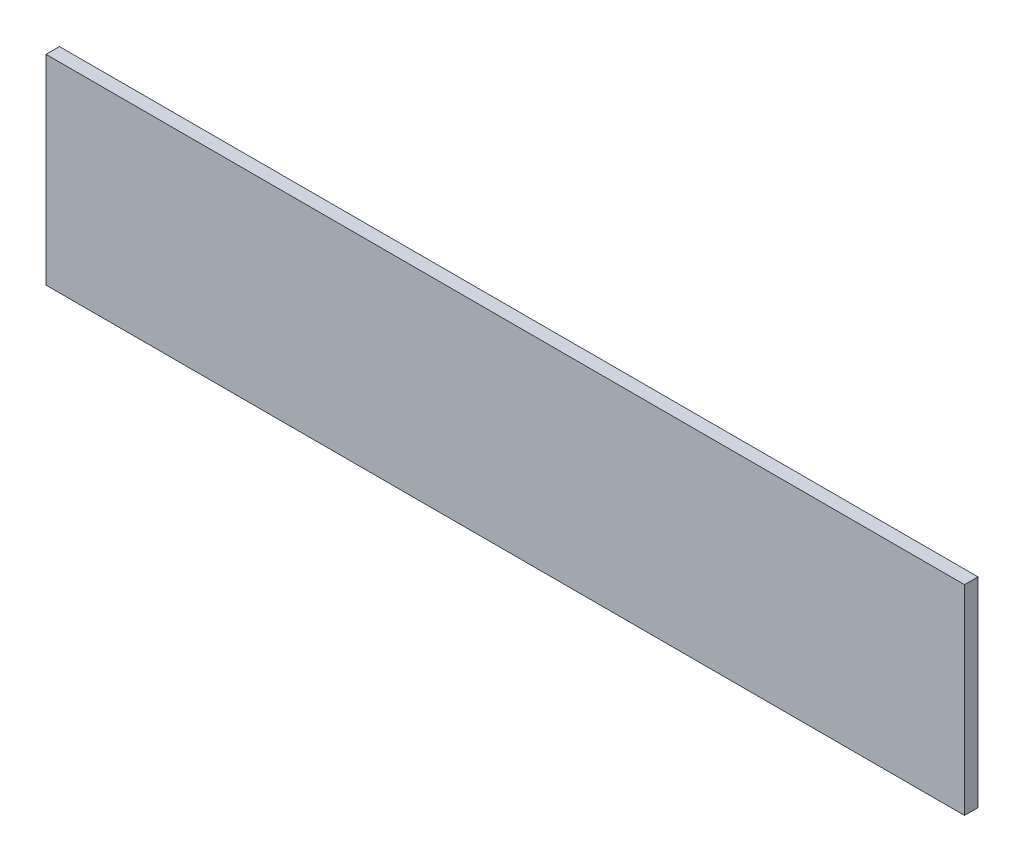
ISO-10303-21;
HEADER;
FILE_DESCRIPTION(('STEP AP214'),'2;1');
FILE_NAME('part.step','',(''),(''),'','','');
FILE_SCHEMA(('AUTOMOTIVE_DESIGN { 1 0 10303 214 1 1 1 1 }'));
ENDSEC;
DATA;
#1=APPLICATION_CONTEXT('core data for automotive mechanical design processes');
#2=APPLICATION_PROTOCOL_DEFINITION('international standard','automotive_design',2000,#1);
#3=PRODUCT_CONTEXT('',#1,'mechanical');
#4=PRODUCT('Part','Part','',(#3));
#5=PRODUCT_RELATED_PRODUCT_CATEGORY('part','',(#4));
#6=PRODUCT_DEFINITION_FORMATION('','',#4);
#7=PRODUCT_DEFINITION_CONTEXT('part definition',#1,'design');
#8=PRODUCT_DEFINITION('design','',#6,#7);
#9=PRODUCT_DEFINITION_SHAPE('','',#8);
#10=(LENGTH_UNIT() NAMED_UNIT(*) SI_UNIT(.MILLI.,.METRE.));
#11=(NAMED_UNIT(*) PLANE_ANGLE_UNIT() SI_UNIT($,.RADIAN.));
#12=(NAMED_UNIT(*) SI_UNIT($,.STERADIAN.) SOLID_ANGLE_UNIT());
#13=UNCERTAINTY_MEASURE_WITH_UNIT(LENGTH_MEASURE(1.E-05),#10,'distance_accuracy_value','');
#14=(GEOMETRIC_REPRESENTATION_CONTEXT(3) GLOBAL_UNCERTAINTY_ASSIGNED_CONTEXT((#13)) GLOBAL_UNIT_ASSIGNED_CONTEXT((#10,
#11,#12)) REPRESENTATION_CONTEXT('',''));
#15=CARTESIAN_POINT('',(0.,0.,0.));
#16=DIRECTION('',(0.,0.,1.));
#17=DIRECTION('',(1.,0.,0.));
#18=AXIS2_PLACEMENT_3D('',#15,#16,#17);
#19=CARTESIAN_POINT('',(19.4828493835392,-636.90036528036,3.));
#20=DIRECTION('',(1.,0.,0.));
#21=DIRECTION('',(0.,1.,0.));
#22=AXIS2_PLACEMENT_3D('',#19,#20,#21);
#23=PLANE('',#22);
#24=DIRECTION('',(0.,-1.,0.));
#25=VECTOR('',#24,1.);
#26=CARTESIAN_POINT('',(19.4828493835392,-636.90036528036,0.));
#27=LINE('',#26,#25);
#28=CARTESIAN_POINT('',(19.4828493835392,-636.90036528036,0.));
#29=VERTEX_POINT('',#28);
#30=CARTESIAN_POINT('',(19.4828493835393,-681.40036528036,0.));
#31=VERTEX_POINT('',#30);
#32=EDGE_CURVE('E117',#29,#31,#27,.T.);
#33=ORIENTED_EDGE('',*,*,#32,.T.);
#34=DIRECTION('',(0.,0.,-1.));
#35=VECTOR('',#34,1.);
#36=CARTESIAN_POINT('',(19.4828493835393,-681.40036528036,3.));
#37=LINE('',#36,#35);
#38=CARTESIAN_POINT('',(19.4828493835393,-681.40036528036,3.));
#39=VERTEX_POINT('',#38);
#40=EDGE_CURVE('E12',#39,#31,#37,.T.);
#41=ORIENTED_EDGE('',*,*,#40,.F.);
#42=DIRECTION('',(0.,-1.,0.));
#43=VECTOR('',#42,1.);
#44=CARTESIAN_POINT('',(19.4828493835392,-636.90036528036,3.));
#45=LINE('',#44,#43);
#46=CARTESIAN_POINT('',(19.4828493835392,-636.90036528036,3.));
#47=VERTEX_POINT('',#46);
#48=EDGE_CURVE('E86',#47,#39,#45,.T.);
#49=ORIENTED_EDGE('',*,*,#48,.F.);
#50=DIRECTION('',(0.,0.,-1.));
#51=VECTOR('',#50,1.);
#52=CARTESIAN_POINT('',(19.4828493835392,-636.90036528036,3.));
#53=LINE('',#52,#51);
#54=EDGE_CURVE('E97',#47,#29,#53,.T.);
#55=ORIENTED_EDGE('',*,*,#54,.T.);
#56=EDGE_LOOP('',(#33,#41,#49,#55));
#57=FACE_BOUND('',#56,.T.);
#58=ADVANCED_FACE('F35',(#57),#23,.F.);
#59=CARTESIAN_POINT('',(19.4828493835393,-681.40036528036,3.));
#60=DIRECTION('',(0.,1.,0.));
#61=DIRECTION('',(0.,0.,1.));
#62=AXIS2_PLACEMENT_3D('',#59,#60,#61);
#63=PLANE('',#62);
#64=DIRECTION('',(1.,0.,0.));
#65=VECTOR('',#64,1.);
#66=CARTESIAN_POINT('',(19.4828493835393,-681.40036528036,0.));
#67=LINE('',#66,#65);
#68=CARTESIAN_POINT('',(223.982849383539,-681.40036528036,0.));
#69=VERTEX_POINT('',#68);
#70=EDGE_CURVE('E91',#31,#69,#67,.T.);
#71=ORIENTED_EDGE('',*,*,#70,.T.);
#72=DIRECTION('',(0.,0.,-1.));
#73=VECTOR('',#72,1.);
#74=CARTESIAN_POINT('',(223.982849383539,-681.40036528036,3.));
#75=LINE('',#74,#73);
#76=CARTESIAN_POINT('',(223.982849383539,-681.40036528036,3.));
#77=VERTEX_POINT('',#76);
#78=EDGE_CURVE('E43',#77,#69,#75,.T.);
#79=ORIENTED_EDGE('',*,*,#78,.F.);
#80=DIRECTION('',(1.,0.,0.));
#81=VECTOR('',#80,1.);
#82=CARTESIAN_POINT('',(19.4828493835393,-681.40036528036,3.));
#83=LINE('',#82,#81);
#84=EDGE_CURVE('E81',#39,#77,#83,.T.);
#85=ORIENTED_EDGE('',*,*,#84,.F.);
#86=ORIENTED_EDGE('',*,*,#40,.T.);
#87=EDGE_LOOP('',(#71,#79,#85,#86));
#88=FACE_BOUND('',#87,.T.);
#89=ADVANCED_FACE('F90',(#88),#63,.F.);
#90=CARTESIAN_POINT('',(223.982849383539,-636.90036528036,3.));
#91=DIRECTION('',(-1.,0.,0.));
#92=DIRECTION('',(0.,0.,1.));
#93=AXIS2_PLACEMENT_3D('',#90,#91,#92);
#94=PLANE('',#93);
#95=DIRECTION('',(0.,1.,0.));
#96=VECTOR('',#95,1.);
#97=CARTESIAN_POINT('',(223.982849383539,-636.90036528036,0.));
#98=LINE('',#97,#96);
#99=CARTESIAN_POINT('',(223.982849383539,-636.90036528036,0.));
#100=VERTEX_POINT('',#99);
#101=EDGE_CURVE('E68',#69,#100,#98,.T.);
#102=ORIENTED_EDGE('',*,*,#101,.T.);
#103=DIRECTION('',(0.,0.,-1.));
#104=VECTOR('',#103,1.);
#105=CARTESIAN_POINT('',(223.982849383539,-636.90036528036,3.));
#106=LINE('',#105,#104);
#107=CARTESIAN_POINT('',(223.982849383539,-636.90036528036,3.));
#108=VERTEX_POINT('',#107);
#109=EDGE_CURVE('E92',#108,#100,#106,.T.);
#110=ORIENTED_EDGE('',*,*,#109,.F.);
#111=DIRECTION('',(0.,1.,0.));
#112=VECTOR('',#111,1.);
#113=CARTESIAN_POINT('',(223.982849383539,-636.90036528036,3.));
#114=LINE('',#113,#112);
#115=EDGE_CURVE('E84',#77,#108,#114,.T.);
#116=ORIENTED_EDGE('',*,*,#115,.F.);
#117=ORIENTED_EDGE('',*,*,#78,.T.);
#118=EDGE_LOOP('',(#102,#110,#116,#117));
#119=FACE_BOUND('',#118,.T.);
#120=ADVANCED_FACE('F93',(#119),#94,.F.);
#121=CARTESIAN_POINT('',(19.4828493835392,-636.90036528036,3.));
#122=DIRECTION('',(0.,-1.,0.));
#123=DIRECTION('',(0.,0.,-1.));
#124=AXIS2_PLACEMENT_3D('',#121,#122,#123);
#125=PLANE('',#124);
#126=DIRECTION('',(-1.,0.,0.));
#127=VECTOR('',#126,1.);
#128=CARTESIAN_POINT('',(19.4828493835392,-636.90036528036,0.));
#129=LINE('',#128,#127);
#130=EDGE_CURVE('E74',#100,#29,#129,.T.);
#131=ORIENTED_EDGE('',*,*,#130,.T.);
#132=ORIENTED_EDGE('',*,*,#54,.F.);
#133=DIRECTION('',(-1.,0.,0.));
#134=VECTOR('',#133,1.);
#135=CARTESIAN_POINT('',(19.4828493835392,-636.90036528036,3.));
#136=LINE('',#135,#134);
#137=EDGE_CURVE('E51',#108,#47,#136,.T.);
#138=ORIENTED_EDGE('',*,*,#137,.F.);
#139=ORIENTED_EDGE('',*,*,#109,.T.);
#140=EDGE_LOOP('',(#131,#132,#138,#139));
#141=FACE_BOUND('',#140,.T.);
#142=ADVANCED_FACE('F112',(#141),#125,.F.);
#143=CARTESIAN_POINT('',(19.4828493835393,-681.40036528036,3.));
#144=DIRECTION('',(0.,0.,1.));
#145=DIRECTION('',(1.,0.,0.));
#146=AXIS2_PLACEMENT_3D('',#143,#144,#145);
#147=PLANE('',#146);
#148=ORIENTED_EDGE('',*,*,#48,.T.);
#149=ORIENTED_EDGE('',*,*,#84,.T.);
#150=ORIENTED_EDGE('',*,*,#115,.T.);
#151=ORIENTED_EDGE('',*,*,#137,.T.);
#152=EDGE_LOOP('',(#148,#149,#150,#151));
#153=FACE_BOUND('',#152,.T.);
#154=ADVANCED_FACE('F82',(#153),#147,.T.);
#155=CARTESIAN_POINT('',(19.4828493835393,-681.40036528036,0.));
#156=DIRECTION('',(0.,0.,1.));
#157=DIRECTION('',(1.,0.,0.));
#158=AXIS2_PLACEMENT_3D('',#155,#156,#157);
#159=PLANE('',#158);
#160=ORIENTED_EDGE('',*,*,#32,.F.);
#161=ORIENTED_EDGE('',*,*,#130,.F.);
#162=ORIENTED_EDGE('',*,*,#101,.F.);
#163=ORIENTED_EDGE('',*,*,#70,.F.);
#164=EDGE_LOOP('',(#160,#161,#162,#163));
#165=FACE_BOUND('',#164,.T.);
#166=ADVANCED_FACE('F115',(#165),#159,.F.);
#167=CLOSED_SHELL('',(#58,#89,#120,#142,#154,#166));
#168=MANIFOLD_SOLID_BREP('B2',#167);
#169=ADVANCED_BREP_SHAPE_REPRESENTATION('',(#18,#168),#14);
#170=SHAPE_DEFINITION_REPRESENTATION(#9,#169);
ENDSEC;
END-ISO-10303-21;
